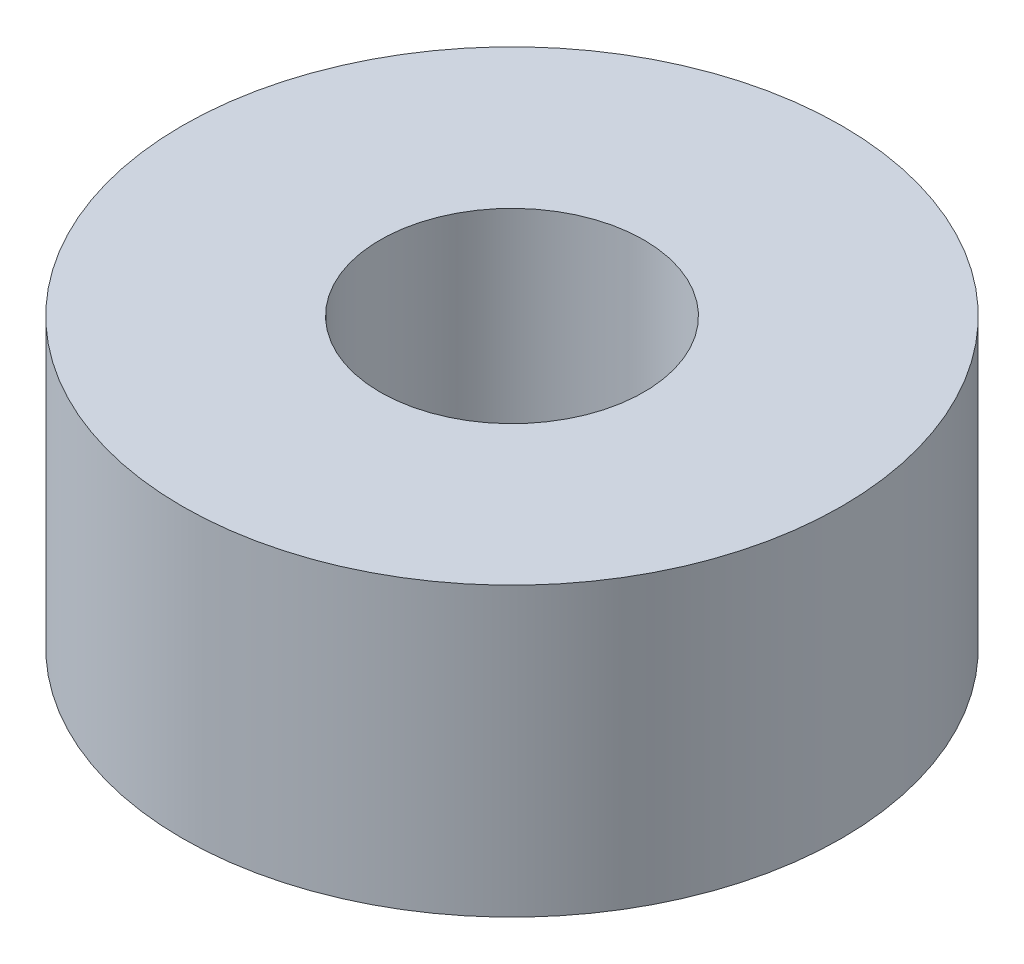
ISO-10303-21;
HEADER;
FILE_DESCRIPTION(('STEP AP214'),'2;1');
FILE_NAME('part.step','',(''),(''),'','','');
FILE_SCHEMA(('AUTOMOTIVE_DESIGN { 1 0 10303 214 1 1 1 1 }'));
ENDSEC;
DATA;
#1=APPLICATION_CONTEXT('core data for automotive mechanical design processes');
#2=APPLICATION_PROTOCOL_DEFINITION('international standard','automotive_design',2000,#1);
#3=PRODUCT_CONTEXT('',#1,'mechanical');
#4=PRODUCT('Part','Part','',(#3));
#5=PRODUCT_RELATED_PRODUCT_CATEGORY('part','',(#4));
#6=PRODUCT_DEFINITION_FORMATION('','',#4);
#7=PRODUCT_DEFINITION_CONTEXT('part definition',#1,'design');
#8=PRODUCT_DEFINITION('design','',#6,#7);
#9=PRODUCT_DEFINITION_SHAPE('','',#8);
#10=(LENGTH_UNIT() NAMED_UNIT(*) SI_UNIT(.MILLI.,.METRE.));
#11=(NAMED_UNIT(*) PLANE_ANGLE_UNIT() SI_UNIT($,.RADIAN.));
#12=(NAMED_UNIT(*) SI_UNIT($,.STERADIAN.) SOLID_ANGLE_UNIT());
#13=UNCERTAINTY_MEASURE_WITH_UNIT(LENGTH_MEASURE(1.E-05),#10,'distance_accuracy_value','');
#14=(GEOMETRIC_REPRESENTATION_CONTEXT(3) GLOBAL_UNCERTAINTY_ASSIGNED_CONTEXT((#13)) GLOBAL_UNIT_ASSIGNED_CONTEXT((#10,
#11,#12)) REPRESENTATION_CONTEXT('',''));
#15=CARTESIAN_POINT('',(0.,0.,0.));
#16=DIRECTION('',(0.,0.,1.));
#17=DIRECTION('',(1.,0.,0.));
#18=AXIS2_PLACEMENT_3D('',#15,#16,#17);
#19=CARTESIAN_POINT('',(0.,5.5372,0.));
#20=DIRECTION('',(0.,1.,0.));
#21=DIRECTION('',(0.,0.,1.));
#22=AXIS2_PLACEMENT_3D('',#19,#20,#21);
#23=PLANE('',#22);
#24=CARTESIAN_POINT('',(0.,5.5372,0.));
#25=DIRECTION('',(0.,1.,0.));
#26=DIRECTION('',(0.,0.,1.));
#27=AXIS2_PLACEMENT_3D('',#24,#25,#26);
#28=CIRCLE('',#27,6.35);
#29=CARTESIAN_POINT('',(0.,5.5372,6.35));
#30=VERTEX_POINT('',#29);
#31=EDGE_CURVE('E10',#30,#30,#28,.T.);
#32=ORIENTED_EDGE('',*,*,#31,.T.);
#33=EDGE_LOOP('',(#32));
#34=FACE_BOUND('',#33,.T.);
#35=CARTESIAN_POINT('',(0.,5.5372,0.));
#36=DIRECTION('',(0.,1.,0.));
#37=DIRECTION('',(0.,0.,1.));
#38=AXIS2_PLACEMENT_3D('',#35,#36,#37);
#39=CIRCLE('',#38,2.54);
#40=CARTESIAN_POINT('',(0.,5.5372,2.54));
#41=VERTEX_POINT('',#40);
#42=EDGE_CURVE('E44',#41,#41,#39,.T.);
#43=ORIENTED_EDGE('',*,*,#42,.F.);
#44=EDGE_LOOP('',(#43));
#45=FACE_BOUND('',#44,.T.);
#46=ADVANCED_FACE('F33',(#34,#45),#23,.T.);
#47=CARTESIAN_POINT('',(0.,0.,0.));
#48=DIRECTION('',(0.,1.,0.));
#49=DIRECTION('',(0.,0.,1.));
#50=AXIS2_PLACEMENT_3D('',#47,#48,#49);
#51=PLANE('',#50);
#52=CARTESIAN_POINT('',(0.,0.,0.));
#53=DIRECTION('',(0.,1.,0.));
#54=DIRECTION('',(0.,0.,1.));
#55=AXIS2_PLACEMENT_3D('',#52,#53,#54);
#56=CIRCLE('',#55,6.35);
#57=CARTESIAN_POINT('',(0.,0.,6.35));
#58=VERTEX_POINT('',#57);
#59=EDGE_CURVE('E37',#58,#58,#56,.T.);
#60=ORIENTED_EDGE('',*,*,#59,.F.);
#61=EDGE_LOOP('',(#60));
#62=FACE_BOUND('',#61,.T.);
#63=CARTESIAN_POINT('',(0.,0.,0.));
#64=DIRECTION('',(0.,1.,0.));
#65=DIRECTION('',(0.,0.,1.));
#66=AXIS2_PLACEMENT_3D('',#63,#64,#65);
#67=CIRCLE('',#66,2.54);
#68=CARTESIAN_POINT('',(0.,0.,2.54));
#69=VERTEX_POINT('',#68);
#70=EDGE_CURVE('E46',#69,#69,#67,.T.);
#71=ORIENTED_EDGE('',*,*,#70,.T.);
#72=EDGE_LOOP('',(#71));
#73=FACE_BOUND('',#72,.T.);
#74=ADVANCED_FACE('F56',(#62,#73),#51,.F.);
#75=CARTESIAN_POINT('',(0.,5.5372,0.));
#76=DIRECTION('',(0.,-1.,0.));
#77=DIRECTION('',(0.,0.,-1.));
#78=AXIS2_PLACEMENT_3D('',#75,#76,#77);
#79=CYLINDRICAL_SURFACE('',#78,6.35);
#80=ORIENTED_EDGE('',*,*,#31,.F.);
#81=EDGE_LOOP('',(#80));
#82=FACE_BOUND('',#81,.T.);
#83=ORIENTED_EDGE('',*,*,#59,.T.);
#84=EDGE_LOOP('',(#83));
#85=FACE_BOUND('',#84,.T.);
#86=ADVANCED_FACE('F35',(#82,#85),#79,.T.);
#87=CARTESIAN_POINT('',(0.,5.5372,0.));
#88=DIRECTION('',(0.,-1.,0.));
#89=DIRECTION('',(0.,0.,-1.));
#90=AXIS2_PLACEMENT_3D('',#87,#88,#89);
#91=CYLINDRICAL_SURFACE('',#90,2.54);
#92=ORIENTED_EDGE('',*,*,#42,.T.);
#93=EDGE_LOOP('',(#92));
#94=FACE_BOUND('',#93,.T.);
#95=ORIENTED_EDGE('',*,*,#70,.F.);
#96=EDGE_LOOP('',(#95));
#97=FACE_BOUND('',#96,.T.);
#98=ADVANCED_FACE('F52',(#94,#97),#91,.F.);
#99=CLOSED_SHELL('',(#46,#74,#86,#98));
#100=MANIFOLD_SOLID_BREP('B2',#99);
#101=ADVANCED_BREP_SHAPE_REPRESENTATION('',(#18,#100),#14);
#102=SHAPE_DEFINITION_REPRESENTATION(#9,#101);
ENDSEC;
END-ISO-10303-21;
